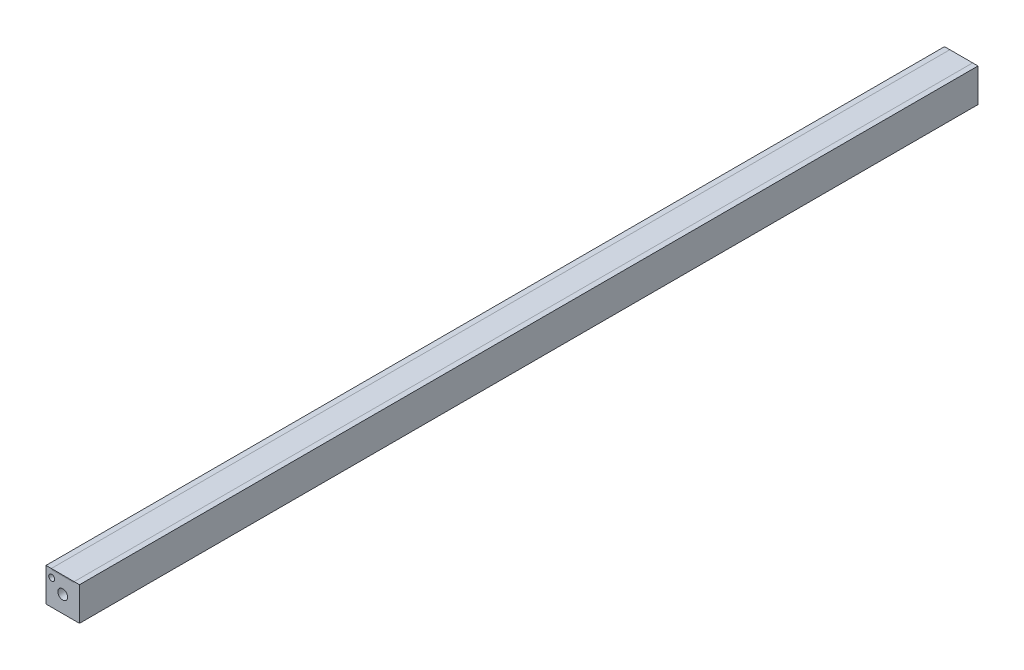
ISO-10303-21;
HEADER;
FILE_DESCRIPTION(('STEP AP214'),'2;1');
FILE_NAME('part.step','',(''),(''),'','','');
FILE_SCHEMA(('AUTOMOTIVE_DESIGN { 1 0 10303 214 1 1 1 1 }'));
ENDSEC;
DATA;
#1=APPLICATION_CONTEXT('core data for automotive mechanical design processes');
#2=APPLICATION_PROTOCOL_DEFINITION('international standard','automotive_design',2000,#1);
#3=PRODUCT_CONTEXT('',#1,'mechanical');
#4=PRODUCT('Part','Part','',(#3));
#5=PRODUCT_RELATED_PRODUCT_CATEGORY('part','',(#4));
#6=PRODUCT_DEFINITION_FORMATION('','',#4);
#7=PRODUCT_DEFINITION_CONTEXT('part definition',#1,'design');
#8=PRODUCT_DEFINITION('design','',#6,#7);
#9=PRODUCT_DEFINITION_SHAPE('','',#8);
#10=(LENGTH_UNIT() NAMED_UNIT(*) SI_UNIT(.MILLI.,.METRE.));
#11=(NAMED_UNIT(*) PLANE_ANGLE_UNIT() SI_UNIT($,.RADIAN.));
#12=(NAMED_UNIT(*) SI_UNIT($,.STERADIAN.) SOLID_ANGLE_UNIT());
#13=UNCERTAINTY_MEASURE_WITH_UNIT(LENGTH_MEASURE(1.E-05),#10,'distance_accuracy_value','');
#14=(GEOMETRIC_REPRESENTATION_CONTEXT(3) GLOBAL_UNCERTAINTY_ASSIGNED_CONTEXT((#13)) GLOBAL_UNIT_ASSIGNED_CONTEXT((#10,
#11,#12)) REPRESENTATION_CONTEXT('',''));
#15=CARTESIAN_POINT('',(0.,0.,0.));
#16=DIRECTION('',(0.,0.,1.));
#17=DIRECTION('',(1.,0.,0.));
#18=AXIS2_PLACEMENT_3D('',#15,#16,#17);
#19=CARTESIAN_POINT('',(15.665,-0.5,500.));
#20=DIRECTION('',(0.,-1.,0.));
#21=DIRECTION('',(0.,0.,-1.));
#22=AXIS2_PLACEMENT_3D('',#19,#20,#21);
#23=PLANE('',#22);
#24=DIRECTION('',(0.,0.,-1.));
#25=VECTOR('',#24,1.);
#26=CARTESIAN_POINT('',(15.665,-0.499999999999945,0.));
#27=LINE('',#26,#25);
#28=CARTESIAN_POINT('',(15.6650000000001,-0.499999999999945,500.));
#29=VERTEX_POINT('',#28);
#30=CARTESIAN_POINT('',(15.665,-0.499999999999945,0.));
#31=VERTEX_POINT('',#30);
#32=EDGE_CURVE('E51',#29,#31,#27,.T.);
#33=ORIENTED_EDGE('',*,*,#32,.F.);
#34=DIRECTION('',(1.,0.,0.));
#35=VECTOR('',#34,1.);
#36=CARTESIAN_POINT('',(15.6650000000001,-0.499999999999945,500.));
#37=LINE('',#36,#35);
#38=CARTESIAN_POINT('',(2.96499999999997,-0.499999999999945,500.));
#39=VERTEX_POINT('',#38);
#40=EDGE_CURVE('E74',#39,#29,#37,.T.);
#41=ORIENTED_EDGE('',*,*,#40,.F.);
#42=DIRECTION('',(0.,0.,1.));
#43=VECTOR('',#42,1.);
#44=CARTESIAN_POINT('',(2.96499999999997,-0.499999999999945,0.));
#45=LINE('',#44,#43);
#46=CARTESIAN_POINT('',(2.96499999999997,-0.499999999999945,0.));
#47=VERTEX_POINT('',#46);
#48=EDGE_CURVE('E79',#47,#39,#45,.T.);
#49=ORIENTED_EDGE('',*,*,#48,.F.);
#50=DIRECTION('',(-1.,0.,0.));
#51=VECTOR('',#50,1.);
#52=CARTESIAN_POINT('',(15.665,-0.499999999999945,0.));
#53=LINE('',#52,#51);
#54=EDGE_CURVE('E94',#31,#47,#53,.T.);
#55=ORIENTED_EDGE('',*,*,#54,.F.);
#56=EDGE_LOOP('',(#33,#41,#49,#55));
#57=FACE_BOUND('',#56,.T.);
#58=ADVANCED_FACE('F43',(#57),#23,.T.);
#59=CARTESIAN_POINT('',(15.6650000000001,0.,500.));
#60=DIRECTION('',(0.,-1.,0.));
#61=DIRECTION('',(0.,0.,-1.));
#62=AXIS2_PLACEMENT_3D('',#59,#60,#61);
#63=PLANE('',#62);
#64=DIRECTION('',(0.,0.,-1.));
#65=VECTOR('',#64,1.);
#66=CARTESIAN_POINT('',(15.665,0.,0.));
#67=LINE('',#66,#65);
#68=CARTESIAN_POINT('',(15.6650000000001,0.,500.));
#69=VERTEX_POINT('',#68);
#70=CARTESIAN_POINT('',(15.665,0.,0.));
#71=VERTEX_POINT('',#70);
#72=EDGE_CURVE('E103',#69,#71,#67,.T.);
#73=ORIENTED_EDGE('',*,*,#72,.T.);
#74=DIRECTION('',(-1.,0.,0.));
#75=VECTOR('',#74,1.);
#76=CARTESIAN_POINT('',(15.665,0.,0.));
#77=LINE('',#76,#75);
#78=CARTESIAN_POINT('',(2.96499999999997,0.,0.));
#79=VERTEX_POINT('',#78);
#80=EDGE_CURVE('E92',#71,#79,#77,.T.);
#81=ORIENTED_EDGE('',*,*,#80,.T.);
#82=DIRECTION('',(0.,0.,1.));
#83=VECTOR('',#82,1.);
#84=CARTESIAN_POINT('',(2.96499999999997,0.,0.));
#85=LINE('',#84,#83);
#86=CARTESIAN_POINT('',(2.96499999999997,0.,500.));
#87=VERTEX_POINT('',#86);
#88=EDGE_CURVE('E95',#79,#87,#85,.T.);
#89=ORIENTED_EDGE('',*,*,#88,.T.);
#90=DIRECTION('',(1.,0.,0.));
#91=VECTOR('',#90,1.);
#92=CARTESIAN_POINT('',(15.6650000000001,0.,500.));
#93=LINE('',#92,#91);
#94=EDGE_CURVE('E100',#87,#69,#93,.T.);
#95=ORIENTED_EDGE('',*,*,#94,.T.);
#96=EDGE_LOOP('',(#73,#81,#89,#95));
#97=FACE_BOUND('',#96,.T.);
#98=ADVANCED_FACE('F102',(#97),#63,.F.);
#99=CARTESIAN_POINT('',(15.665,-500.661263993924,0.));
#100=DIRECTION('',(0.,0.,-1.));
#101=DIRECTION('',(-1.,0.,0.));
#102=AXIS2_PLACEMENT_3D('',#99,#100,#101);
#103=PLANE('',#102);
#104=DIRECTION('',(0.,1.,0.));
#105=VECTOR('',#104,1.);
#106=CARTESIAN_POINT('',(15.665,-500.661263993924,0.));
#107=LINE('',#106,#105);
#108=EDGE_CURVE('E12',#31,#71,#107,.T.);
#109=ORIENTED_EDGE('',*,*,#108,.F.);
#110=ORIENTED_EDGE('',*,*,#54,.T.);
#111=DIRECTION('',(0.,1.,0.));
#112=VECTOR('',#111,1.);
#113=CARTESIAN_POINT('',(2.96499999999997,-500.661263993924,0.));
#114=LINE('',#113,#112);
#115=EDGE_CURVE('E89',#47,#79,#114,.T.);
#116=ORIENTED_EDGE('',*,*,#115,.T.);
#117=ORIENTED_EDGE('',*,*,#80,.F.);
#118=EDGE_LOOP('',(#109,#110,#116,#117));
#119=FACE_BOUND('',#118,.T.);
#120=ADVANCED_FACE('F90',(#119),#103,.T.);
#121=CARTESIAN_POINT('',(2.96499999999997,-500.661263993924,0.));
#122=DIRECTION('',(-1.,0.,0.));
#123=DIRECTION('',(0.,0.,1.));
#124=AXIS2_PLACEMENT_3D('',#121,#122,#123);
#125=PLANE('',#124);
#126=ORIENTED_EDGE('',*,*,#115,.F.);
#127=ORIENTED_EDGE('',*,*,#48,.T.);
#128=DIRECTION('',(0.,1.,0.));
#129=VECTOR('',#128,1.);
#130=CARTESIAN_POINT('',(2.96499999999997,-500.661263993924,500.));
#131=LINE('',#130,#129);
#132=EDGE_CURVE('E84',#39,#87,#131,.T.);
#133=ORIENTED_EDGE('',*,*,#132,.T.);
#134=ORIENTED_EDGE('',*,*,#88,.F.);
#135=EDGE_LOOP('',(#126,#127,#133,#134));
#136=FACE_BOUND('',#135,.T.);
#137=ADVANCED_FACE('F96',(#136),#125,.T.);
#138=CARTESIAN_POINT('',(15.6650000000001,-500.661263993924,500.));
#139=DIRECTION('',(0.,0.,1.));
#140=DIRECTION('',(1.,0.,0.));
#141=AXIS2_PLACEMENT_3D('',#138,#139,#140);
#142=PLANE('',#141);
#143=ORIENTED_EDGE('',*,*,#132,.F.);
#144=ORIENTED_EDGE('',*,*,#40,.T.);
#145=DIRECTION('',(0.,1.,0.));
#146=VECTOR('',#145,1.);
#147=CARTESIAN_POINT('',(15.6650000000001,-500.661263993924,500.));
#148=LINE('',#147,#146);
#149=EDGE_CURVE('E110',#29,#69,#148,.T.);
#150=ORIENTED_EDGE('',*,*,#149,.T.);
#151=ORIENTED_EDGE('',*,*,#94,.F.);
#152=EDGE_LOOP('',(#143,#144,#150,#151));
#153=FACE_BOUND('',#152,.T.);
#154=ADVANCED_FACE('F116',(#153),#142,.T.);
#155=CARTESIAN_POINT('',(15.665,-500.661263993924,0.));
#156=DIRECTION('',(1.,0.,0.));
#157=DIRECTION('',(0.,0.,-1.));
#158=AXIS2_PLACEMENT_3D('',#155,#156,#157);
#159=PLANE('',#158);
#160=ORIENTED_EDGE('',*,*,#149,.F.);
#161=ORIENTED_EDGE('',*,*,#32,.T.);
#162=ORIENTED_EDGE('',*,*,#108,.T.);
#163=ORIENTED_EDGE('',*,*,#72,.F.);
#164=EDGE_LOOP('',(#160,#161,#162,#163));
#165=FACE_BOUND('',#164,.T.);
#166=ADVANCED_FACE('F117',(#165),#159,.T.);
#167=CLOSED_SHELL('',(#58,#98,#120,#137,#154,#166));
#168=MANIFOLD_SOLID_BREP('B2',#167);
#169=CARTESIAN_POINT('',(0.,0.,500.));
#170=DIRECTION('',(0.,-1.,0.));
#171=DIRECTION('',(0.,0.,-1.));
#172=AXIS2_PLACEMENT_3D('',#169,#170,#171);
#173=PLANE('',#172);
#174=DIRECTION('',(-1.,0.,0.));
#175=VECTOR('',#174,1.);
#176=CARTESIAN_POINT('',(0.,0.,0.));
#177=LINE('',#176,#175);
#178=CARTESIAN_POINT('',(18.63,0.,0.));
#179=VERTEX_POINT('',#178);
#180=CARTESIAN_POINT('',(15.665,0.,0.));
#181=VERTEX_POINT('',#180);
#182=EDGE_CURVE('E292',#179,#181,#177,.T.);
#183=ORIENTED_EDGE('',*,*,#182,.T.);
#184=DIRECTION('',(0.,0.,-1.));
#185=VECTOR('',#184,1.);
#186=CARTESIAN_POINT('',(15.665,0.,0.));
#187=LINE('',#186,#185);
#188=CARTESIAN_POINT('',(15.665,0.,500.));
#189=VERTEX_POINT('',#188);
#190=EDGE_CURVE('E321',#189,#181,#187,.T.);
#191=ORIENTED_EDGE('',*,*,#190,.F.);
#192=DIRECTION('',(-1.,0.,0.));
#193=VECTOR('',#192,1.);
#194=CARTESIAN_POINT('',(0.,0.,500.));
#195=LINE('',#194,#193);
#196=CARTESIAN_POINT('',(18.63,0.,500.));
#197=VERTEX_POINT('',#196);
#198=EDGE_CURVE('E296',#197,#189,#195,.T.);
#199=ORIENTED_EDGE('',*,*,#198,.F.);
#200=DIRECTION('',(0.,0.,-1.));
#201=VECTOR('',#200,1.);
#202=CARTESIAN_POINT('',(18.63,0.,500.));
#203=LINE('',#202,#201);
#204=EDGE_CURVE('E309',#197,#179,#203,.T.);
#205=ORIENTED_EDGE('',*,*,#204,.T.);
#206=EDGE_LOOP('',(#183,#191,#199,#205));
#207=FACE_BOUND('',#206,.T.);
#208=ADVANCED_FACE('F167',(#207),#173,.F.);
#209=CARTESIAN_POINT('',(0.,0.,500.));
#210=DIRECTION('',(1.,0.,0.));
#211=DIRECTION('',(0.,1.,0.));
#212=AXIS2_PLACEMENT_3D('',#209,#210,#211);
#213=PLANE('',#212);
#214=DIRECTION('',(0.,-1.,0.));
#215=VECTOR('',#214,1.);
#216=CARTESIAN_POINT('',(0.,0.,0.));
#217=LINE('',#216,#215);
#218=CARTESIAN_POINT('',(0.,0.,0.));
#219=VERTEX_POINT('',#218);
#220=CARTESIAN_POINT('',(0.,-18.63,0.));
#221=VERTEX_POINT('',#220);
#222=EDGE_CURVE('E287',#219,#221,#217,.T.);
#223=ORIENTED_EDGE('',*,*,#222,.T.);
#224=DIRECTION('',(0.,0.,-1.));
#225=VECTOR('',#224,1.);
#226=CARTESIAN_POINT('',(0.,-18.63,500.));
#227=LINE('',#226,#225);
#228=CARTESIAN_POINT('',(0.,-18.63,500.));
#229=VERTEX_POINT('',#228);
#230=EDGE_CURVE('E41',#229,#221,#227,.T.);
#231=ORIENTED_EDGE('',*,*,#230,.F.);
#232=DIRECTION('',(0.,-1.,0.));
#233=VECTOR('',#232,1.);
#234=CARTESIAN_POINT('',(0.,0.,500.));
#235=LINE('',#234,#233);
#236=CARTESIAN_POINT('',(0.,0.,500.));
#237=VERTEX_POINT('',#236);
#238=EDGE_CURVE('E290',#237,#229,#235,.T.);
#239=ORIENTED_EDGE('',*,*,#238,.F.);
#240=DIRECTION('',(0.,0.,-1.));
#241=VECTOR('',#240,1.);
#242=CARTESIAN_POINT('',(0.,0.,500.));
#243=LINE('',#242,#241);
#244=EDGE_CURVE('E299',#237,#219,#243,.T.);
#245=ORIENTED_EDGE('',*,*,#244,.T.);
#246=EDGE_LOOP('',(#223,#231,#239,#245));
#247=FACE_BOUND('',#246,.T.);
#248=ADVANCED_FACE('F169',(#247),#213,.F.);
#249=CARTESIAN_POINT('',(0.,-18.63,500.));
#250=DIRECTION('',(0.,1.,0.));
#251=DIRECTION('',(0.,0.,1.));
#252=AXIS2_PLACEMENT_3D('',#249,#250,#251);
#253=PLANE('',#252);
#254=DIRECTION('',(1.,0.,0.));
#255=VECTOR('',#254,1.);
#256=CARTESIAN_POINT('',(0.,-18.63,0.));
#257=LINE('',#256,#255);
#258=CARTESIAN_POINT('',(18.63,-18.63,0.));
#259=VERTEX_POINT('',#258);
#260=EDGE_CURVE('E302',#221,#259,#257,.T.);
#261=ORIENTED_EDGE('',*,*,#260,.T.);
#262=DIRECTION('',(0.,0.,-1.));
#263=VECTOR('',#262,1.);
#264=CARTESIAN_POINT('',(18.63,-18.63,500.));
#265=LINE('',#264,#263);
#266=CARTESIAN_POINT('',(18.63,-18.63,500.));
#267=VERTEX_POINT('',#266);
#268=EDGE_CURVE('E175',#267,#259,#265,.T.);
#269=ORIENTED_EDGE('',*,*,#268,.F.);
#270=DIRECTION('',(1.,0.,0.));
#271=VECTOR('',#270,1.);
#272=CARTESIAN_POINT('',(0.,-18.63,500.));
#273=LINE('',#272,#271);
#274=EDGE_CURVE('E220',#229,#267,#273,.T.);
#275=ORIENTED_EDGE('',*,*,#274,.F.);
#276=ORIENTED_EDGE('',*,*,#230,.T.);
#277=EDGE_LOOP('',(#261,#269,#275,#276));
#278=FACE_BOUND('',#277,.T.);
#279=ADVANCED_FACE('F328',(#278),#253,.F.);
#280=CARTESIAN_POINT('',(18.63,0.,500.));
#281=DIRECTION('',(-1.,0.,0.));
#282=DIRECTION('',(0.,-1.,0.));
#283=AXIS2_PLACEMENT_3D('',#280,#281,#282);
#284=PLANE('',#283);
#285=DIRECTION('',(0.,1.,0.));
#286=VECTOR('',#285,1.);
#287=CARTESIAN_POINT('',(18.63,0.,0.));
#288=LINE('',#287,#286);
#289=EDGE_CURVE('E304',#259,#179,#288,.T.);
#290=ORIENTED_EDGE('',*,*,#289,.T.);
#291=ORIENTED_EDGE('',*,*,#204,.F.);
#292=DIRECTION('',(0.,1.,0.));
#293=VECTOR('',#292,1.);
#294=CARTESIAN_POINT('',(18.63,0.,500.));
#295=LINE('',#294,#293);
#296=EDGE_CURVE('E294',#267,#197,#295,.T.);
#297=ORIENTED_EDGE('',*,*,#296,.F.);
#298=ORIENTED_EDGE('',*,*,#268,.T.);
#299=EDGE_LOOP('',(#290,#291,#297,#298));
#300=FACE_BOUND('',#299,.T.);
#301=ADVANCED_FACE('F315',(#300),#284,.F.);
#302=CARTESIAN_POINT('',(2.965,0.,500.));
#303=VERTEX_POINT('',#302);
#304=EDGE_CURVE('E191',#303,#237,#195,.T.);
#305=ORIENTED_EDGE('',*,*,#304,.F.);
#306=DIRECTION('',(0.,0.,1.));
#307=VECTOR('',#306,1.);
#308=CARTESIAN_POINT('',(2.965,0.,0.));
#309=LINE('',#308,#307);
#310=CARTESIAN_POINT('',(2.965,0.,0.));
#311=VERTEX_POINT('',#310);
#312=EDGE_CURVE('E346',#311,#303,#309,.T.);
#313=ORIENTED_EDGE('',*,*,#312,.F.);
#314=EDGE_CURVE('E213',#311,#219,#177,.T.);
#315=ORIENTED_EDGE('',*,*,#314,.T.);
#316=ORIENTED_EDGE('',*,*,#244,.F.);
#317=EDGE_LOOP('',(#305,#313,#315,#316));
#318=FACE_BOUND('',#317,.T.);
#319=ADVANCED_FACE('F334',(#318),#173,.F.);
#320=CARTESIAN_POINT('',(0.,-18.63,500.));
#321=DIRECTION('',(0.,0.,1.));
#322=DIRECTION('',(1.,0.,0.));
#323=AXIS2_PLACEMENT_3D('',#320,#321,#322);
#324=PLANE('',#323);
#325=DIRECTION('',(0.,1.,0.));
#326=VECTOR('',#325,1.);
#327=CARTESIAN_POINT('',(15.665,-0.5,500.));
#328=LINE('',#327,#326);
#329=CARTESIAN_POINT('',(15.665,-0.5,500.));
#330=VERTEX_POINT('',#329);
#331=EDGE_CURVE('E260',#330,#189,#328,.T.);
#332=ORIENTED_EDGE('',*,*,#331,.F.);
#333=DIRECTION('',(1.,0.,0.));
#334=VECTOR('',#333,1.);
#335=CARTESIAN_POINT('',(15.665,-0.5,500.));
#336=LINE('',#335,#334);
#337=CARTESIAN_POINT('',(2.965,-0.5,500.));
#338=VERTEX_POINT('',#337);
#339=EDGE_CURVE('E248',#338,#330,#336,.T.);
#340=ORIENTED_EDGE('',*,*,#339,.F.);
#341=DIRECTION('',(0.,1.,0.));
#342=VECTOR('',#341,1.);
#343=CARTESIAN_POINT('',(2.965,-0.5,500.));
#344=LINE('',#343,#342);
#345=EDGE_CURVE('E246',#338,#303,#344,.T.);
#346=ORIENTED_EDGE('',*,*,#345,.T.);
#347=ORIENTED_EDGE('',*,*,#304,.T.);
#348=ORIENTED_EDGE('',*,*,#238,.T.);
#349=ORIENTED_EDGE('',*,*,#274,.T.);
#350=ORIENTED_EDGE('',*,*,#296,.T.);
#351=ORIENTED_EDGE('',*,*,#198,.T.);
#352=EDGE_LOOP('',(#332,#340,#346,#347,#348,#349,#350,#351));
#353=FACE_BOUND('',#352,.T.);
#354=CARTESIAN_POINT('',(3.18,-4.34499999999981,500.));
#355=DIRECTION('',(0.,0.,1.));
#356=DIRECTION('',(1.,0.,0.));
#357=AXIS2_PLACEMENT_3D('',#354,#355,#356);
#358=CIRCLE('',#357,1.67);
#359=CARTESIAN_POINT('',(4.85,-4.34499999999981,500.));
#360=VERTEX_POINT('',#359);
#361=EDGE_CURVE('E269',#360,#360,#358,.T.);
#362=ORIENTED_EDGE('',*,*,#361,.F.);
#363=EDGE_LOOP('',(#362));
#364=FACE_BOUND('',#363,.T.);
#365=CARTESIAN_POINT('',(9.315,-9.315,500.));
#366=DIRECTION('',(0.,0.,1.));
#367=DIRECTION('',(1.,0.,0.));
#368=AXIS2_PLACEMENT_3D('',#365,#366,#367);
#369=CIRCLE('',#368,2.71);
#370=CARTESIAN_POINT('',(12.025,-9.315,500.));
#371=VERTEX_POINT('',#370);
#372=EDGE_CURVE('E275',#371,#371,#369,.T.);
#373=ORIENTED_EDGE('',*,*,#372,.F.);
#374=EDGE_LOOP('',(#373));
#375=FACE_BOUND('',#374,.T.);
#376=ADVANCED_FACE('F323',(#353,#364,#375),#324,.T.);
#377=CARTESIAN_POINT('',(0.,-18.63,0.));
#378=DIRECTION('',(0.,0.,1.));
#379=DIRECTION('',(1.,0.,0.));
#380=AXIS2_PLACEMENT_3D('',#377,#378,#379);
#381=PLANE('',#380);
#382=CARTESIAN_POINT('',(14.95,-3.73,0.));
#383=DIRECTION('',(0.,0.,-1.));
#384=DIRECTION('',(-1.,0.,0.));
#385=AXIS2_PLACEMENT_3D('',#382,#383,#384);
#386=CIRCLE('',#385,1.67);
#387=CARTESIAN_POINT('',(13.28,-3.73,0.));
#388=VERTEX_POINT('',#387);
#389=EDGE_CURVE('E268',#388,#388,#386,.T.);
#390=ORIENTED_EDGE('',*,*,#389,.F.);
#391=EDGE_LOOP('',(#390));
#392=FACE_BOUND('',#391,.T.);
#393=CARTESIAN_POINT('',(9.315,-9.315,0.));
#394=DIRECTION('',(0.,0.,-1.));
#395=DIRECTION('',(-1.,0.,0.));
#396=AXIS2_PLACEMENT_3D('',#393,#394,#395);
#397=CIRCLE('',#396,2.71);
#398=CARTESIAN_POINT('',(6.605,-9.315,0.));
#399=VERTEX_POINT('',#398);
#400=EDGE_CURVE('E281',#399,#399,#397,.T.);
#401=ORIENTED_EDGE('',*,*,#400,.F.);
#402=EDGE_LOOP('',(#401));
#403=FACE_BOUND('',#402,.T.);
#404=DIRECTION('',(-1.,0.,0.));
#405=VECTOR('',#404,1.);
#406=CARTESIAN_POINT('',(15.665,-0.5,0.));
#407=LINE('',#406,#405);
#408=CARTESIAN_POINT('',(15.665,-0.5,0.));
#409=VERTEX_POINT('',#408);
#410=CARTESIAN_POINT('',(2.965,-0.5,0.));
#411=VERTEX_POINT('',#410);
#412=EDGE_CURVE('E249',#409,#411,#407,.T.);
#413=ORIENTED_EDGE('',*,*,#412,.F.);
#414=DIRECTION('',(0.,1.,0.));
#415=VECTOR('',#414,1.);
#416=CARTESIAN_POINT('',(15.665,-0.5,0.));
#417=LINE('',#416,#415);
#418=EDGE_CURVE('E258',#409,#181,#417,.T.);
#419=ORIENTED_EDGE('',*,*,#418,.T.);
#420=ORIENTED_EDGE('',*,*,#182,.F.);
#421=ORIENTED_EDGE('',*,*,#289,.F.);
#422=ORIENTED_EDGE('',*,*,#260,.F.);
#423=ORIENTED_EDGE('',*,*,#222,.F.);
#424=ORIENTED_EDGE('',*,*,#314,.F.);
#425=DIRECTION('',(0.,1.,0.));
#426=VECTOR('',#425,1.);
#427=CARTESIAN_POINT('',(2.965,-0.5,0.));
#428=LINE('',#427,#426);
#429=EDGE_CURVE('E245',#411,#311,#428,.T.);
#430=ORIENTED_EDGE('',*,*,#429,.F.);
#431=EDGE_LOOP('',(#413,#419,#420,#421,#422,#423,#424,#430));
#432=FACE_BOUND('',#431,.T.);
#433=ADVANCED_FACE('F256',(#392,#403,#432),#381,.F.);
#434=CARTESIAN_POINT('',(9.315,-9.315,24.));
#435=DIRECTION('',(0.,0.,-1.));
#436=DIRECTION('',(-1.,0.,0.));
#437=AXIS2_PLACEMENT_3D('',#434,#435,#436);
#438=CYLINDRICAL_SURFACE('',#437,2.71);
#439=CARTESIAN_POINT('',(9.315,-9.315,24.));
#440=DIRECTION('',(0.,0.,-1.));
#441=DIRECTION('',(-1.,0.,0.));
#442=AXIS2_PLACEMENT_3D('',#439,#440,#441);
#443=CIRCLE('',#442,2.71);
#444=CARTESIAN_POINT('',(6.605,-9.315,24.));
#445=VERTEX_POINT('',#444);
#446=EDGE_CURVE('E284',#445,#445,#443,.T.);
#447=ORIENTED_EDGE('',*,*,#446,.F.);
#448=EDGE_LOOP('',(#447));
#449=FACE_BOUND('',#448,.T.);
#450=ORIENTED_EDGE('',*,*,#400,.T.);
#451=EDGE_LOOP('',(#450));
#452=FACE_BOUND('',#451,.T.);
#453=ADVANCED_FACE('F388',(#449,#452),#438,.F.);
#454=CARTESIAN_POINT('',(9.315,-9.315,24.));
#455=DIRECTION('',(0.,0.,-1.));
#456=DIRECTION('',(-1.,0.,0.));
#457=AXIS2_PLACEMENT_3D('',#454,#455,#456);
#458=PLANE('',#457);
#459=ORIENTED_EDGE('',*,*,#446,.T.);
#460=EDGE_LOOP('',(#459));
#461=FACE_BOUND('',#460,.T.);
#462=ADVANCED_FACE('F384',(#461),#458,.T.);
#463=CARTESIAN_POINT('',(9.315,-9.315,476.));
#464=DIRECTION('',(0.,0.,1.));
#465=DIRECTION('',(1.,0.,0.));
#466=AXIS2_PLACEMENT_3D('',#463,#464,#465);
#467=CYLINDRICAL_SURFACE('',#466,2.71);
#468=CARTESIAN_POINT('',(9.315,-9.315,476.));
#469=DIRECTION('',(0.,0.,1.));
#470=DIRECTION('',(1.,0.,0.));
#471=AXIS2_PLACEMENT_3D('',#468,#469,#470);
#472=CIRCLE('',#471,2.71);
#473=CARTESIAN_POINT('',(12.025,-9.315,476.));
#474=VERTEX_POINT('',#473);
#475=EDGE_CURVE('E278',#474,#474,#472,.T.);
#476=ORIENTED_EDGE('',*,*,#475,.F.);
#477=EDGE_LOOP('',(#476));
#478=FACE_BOUND('',#477,.T.);
#479=ORIENTED_EDGE('',*,*,#372,.T.);
#480=EDGE_LOOP('',(#479));
#481=FACE_BOUND('',#480,.T.);
#482=ADVANCED_FACE('F380',(#478,#481),#467,.F.);
#483=CARTESIAN_POINT('',(9.315,-9.315,476.));
#484=DIRECTION('',(0.,0.,1.));
#485=DIRECTION('',(1.,0.,0.));
#486=AXIS2_PLACEMENT_3D('',#483,#484,#485);
#487=PLANE('',#486);
#488=ORIENTED_EDGE('',*,*,#475,.T.);
#489=EDGE_LOOP('',(#488));
#490=FACE_BOUND('',#489,.T.);
#491=ADVANCED_FACE('F376',(#490),#487,.T.);
#492=CARTESIAN_POINT('',(14.95,-3.73,10.));
#493=DIRECTION('',(0.,0.,-1.));
#494=DIRECTION('',(-1.,0.,0.));
#495=AXIS2_PLACEMENT_3D('',#492,#493,#494);
#496=CYLINDRICAL_SURFACE('',#495,1.67);
#497=CARTESIAN_POINT('',(14.95,-3.73,10.));
#498=DIRECTION('',(0.,0.,-1.));
#499=DIRECTION('',(-1.,0.,0.));
#500=AXIS2_PLACEMENT_3D('',#497,#498,#499);
#501=CIRCLE('',#500,1.67);
#502=CARTESIAN_POINT('',(13.28,-3.73,10.));
#503=VERTEX_POINT('',#502);
#504=EDGE_CURVE('E272',#503,#503,#501,.T.);
#505=ORIENTED_EDGE('',*,*,#504,.F.);
#506=EDGE_LOOP('',(#505));
#507=FACE_BOUND('',#506,.T.);
#508=ORIENTED_EDGE('',*,*,#389,.T.);
#509=EDGE_LOOP('',(#508));
#510=FACE_BOUND('',#509,.T.);
#511=ADVANCED_FACE('F372',(#507,#510),#496,.F.);
#512=CARTESIAN_POINT('',(14.95,-3.73,10.));
#513=DIRECTION('',(0.,0.,-1.));
#514=DIRECTION('',(-1.,0.,0.));
#515=AXIS2_PLACEMENT_3D('',#512,#513,#514);
#516=PLANE('',#515);
#517=ORIENTED_EDGE('',*,*,#504,.T.);
#518=EDGE_LOOP('',(#517));
#519=FACE_BOUND('',#518,.T.);
#520=ADVANCED_FACE('F368',(#519),#516,.T.);
#521=CARTESIAN_POINT('',(3.18,-4.34499999999981,490.));
#522=DIRECTION('',(0.,0.,1.));
#523=DIRECTION('',(1.,0.,0.));
#524=AXIS2_PLACEMENT_3D('',#521,#522,#523);
#525=CYLINDRICAL_SURFACE('',#524,1.67);
#526=CARTESIAN_POINT('',(3.18,-4.34499999999981,490.));
#527=DIRECTION('',(0.,0.,1.));
#528=DIRECTION('',(1.,0.,0.));
#529=AXIS2_PLACEMENT_3D('',#526,#527,#528);
#530=CIRCLE('',#529,1.67);
#531=CARTESIAN_POINT('',(4.85,-4.34499999999981,490.));
#532=VERTEX_POINT('',#531);
#533=EDGE_CURVE('E265',#532,#532,#530,.T.);
#534=ORIENTED_EDGE('',*,*,#533,.F.);
#535=EDGE_LOOP('',(#534));
#536=FACE_BOUND('',#535,.T.);
#537=ORIENTED_EDGE('',*,*,#361,.T.);
#538=EDGE_LOOP('',(#537));
#539=FACE_BOUND('',#538,.T.);
#540=ADVANCED_FACE('F361',(#536,#539),#525,.F.);
#541=CARTESIAN_POINT('',(3.18,-4.34499999999981,490.));
#542=DIRECTION('',(0.,0.,1.));
#543=DIRECTION('',(1.,0.,0.));
#544=AXIS2_PLACEMENT_3D('',#541,#542,#543);
#545=PLANE('',#544);
#546=ORIENTED_EDGE('',*,*,#533,.T.);
#547=EDGE_LOOP('',(#546));
#548=FACE_BOUND('',#547,.T.);
#549=ADVANCED_FACE('F354',(#548),#545,.T.);
#550=CARTESIAN_POINT('',(15.665,-0.5,0.));
#551=DIRECTION('',(1.,0.,0.));
#552=DIRECTION('',(0.,0.,-1.));
#553=AXIS2_PLACEMENT_3D('',#550,#551,#552);
#554=PLANE('',#553);
#555=ORIENTED_EDGE('',*,*,#190,.T.);
#556=ORIENTED_EDGE('',*,*,#418,.F.);
#557=DIRECTION('',(0.,0.,-1.));
#558=VECTOR('',#557,1.);
#559=CARTESIAN_POINT('',(15.665,-0.5,0.));
#560=LINE('',#559,#558);
#561=EDGE_CURVE('E182',#330,#409,#560,.T.);
#562=ORIENTED_EDGE('',*,*,#561,.F.);
#563=ORIENTED_EDGE('',*,*,#331,.T.);
#564=EDGE_LOOP('',(#555,#556,#562,#563));
#565=FACE_BOUND('',#564,.T.);
#566=ADVANCED_FACE('F352',(#565),#554,.F.);
#567=CARTESIAN_POINT('',(2.965,-0.5,0.));
#568=DIRECTION('',(-1.,0.,0.));
#569=DIRECTION('',(0.,0.,1.));
#570=AXIS2_PLACEMENT_3D('',#567,#568,#569);
#571=PLANE('',#570);
#572=ORIENTED_EDGE('',*,*,#312,.T.);
#573=ORIENTED_EDGE('',*,*,#345,.F.);
#574=DIRECTION('',(0.,0.,1.));
#575=VECTOR('',#574,1.);
#576=CARTESIAN_POINT('',(2.965,-0.5,0.));
#577=LINE('',#576,#575);
#578=EDGE_CURVE('E242',#411,#338,#577,.T.);
#579=ORIENTED_EDGE('',*,*,#578,.F.);
#580=ORIENTED_EDGE('',*,*,#429,.T.);
#581=EDGE_LOOP('',(#572,#573,#579,#580));
#582=FACE_BOUND('',#581,.T.);
#583=ADVANCED_FACE('F243',(#582),#571,.F.);
#584=CARTESIAN_POINT('',(15.665,-0.5,500.));
#585=DIRECTION('',(0.,-1.,0.));
#586=DIRECTION('',(0.,0.,-1.));
#587=AXIS2_PLACEMENT_3D('',#584,#585,#586);
#588=PLANE('',#587);
#589=ORIENTED_EDGE('',*,*,#561,.T.);
#590=ORIENTED_EDGE('',*,*,#412,.T.);
#591=ORIENTED_EDGE('',*,*,#578,.T.);
#592=ORIENTED_EDGE('',*,*,#339,.T.);
#593=EDGE_LOOP('',(#589,#590,#591,#592));
#594=FACE_BOUND('',#593,.T.);
#595=ADVANCED_FACE('F252',(#594),#588,.F.);
#596=CLOSED_SHELL('',(#208,#248,#279,#301,#319,#376,#433,#453,#462,#482,#491,#511,#520,#540,
#549,#566,#583,#595));
#597=MANIFOLD_SOLID_BREP('B6',#596);
#598=ADVANCED_BREP_SHAPE_REPRESENTATION('',(#18,#168,#597),#14);
#599=SHAPE_DEFINITION_REPRESENTATION(#9,#598);
ENDSEC;
END-ISO-10303-21;
